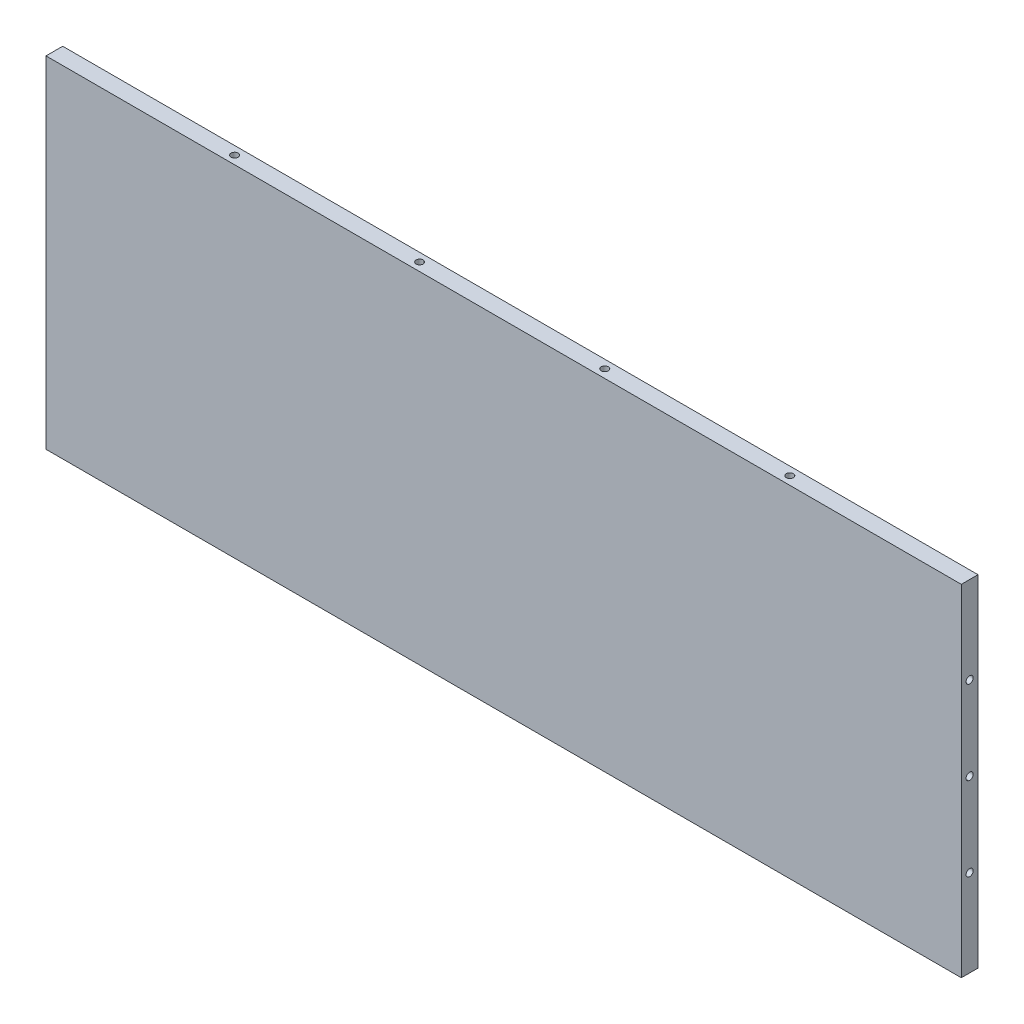
ISO-10303-21;
HEADER;
FILE_DESCRIPTION(('STEP AP214'),'2;1');
FILE_NAME('part.step','',(''),(''),'','','');
FILE_SCHEMA(('AUTOMOTIVE_DESIGN { 1 0 10303 214 1 1 1 1 }'));
ENDSEC;
DATA;
#1=APPLICATION_CONTEXT('core data for automotive mechanical design processes');
#2=APPLICATION_PROTOCOL_DEFINITION('international standard','automotive_design',2000,#1);
#3=PRODUCT_CONTEXT('',#1,'mechanical');
#4=PRODUCT('Part','Part','',(#3));
#5=PRODUCT_RELATED_PRODUCT_CATEGORY('part','',(#4));
#6=PRODUCT_DEFINITION_FORMATION('','',#4);
#7=PRODUCT_DEFINITION_CONTEXT('part definition',#1,'design');
#8=PRODUCT_DEFINITION('design','',#6,#7);
#9=PRODUCT_DEFINITION_SHAPE('','',#8);
#10=(LENGTH_UNIT() NAMED_UNIT(*) SI_UNIT(.MILLI.,.METRE.));
#11=(NAMED_UNIT(*) PLANE_ANGLE_UNIT() SI_UNIT($,.RADIAN.));
#12=(NAMED_UNIT(*) SI_UNIT($,.STERADIAN.) SOLID_ANGLE_UNIT());
#13=UNCERTAINTY_MEASURE_WITH_UNIT(LENGTH_MEASURE(1.E-05),#10,'distance_accuracy_value','');
#14=(GEOMETRIC_REPRESENTATION_CONTEXT(3) GLOBAL_UNCERTAINTY_ASSIGNED_CONTEXT((#13)) GLOBAL_UNIT_ASSIGNED_CONTEXT((#10,
#11,#12)) REPRESENTATION_CONTEXT('',''));
#15=CARTESIAN_POINT('',(0.,0.,0.));
#16=DIRECTION('',(0.,0.,1.));
#17=DIRECTION('',(1.,0.,0.));
#18=AXIS2_PLACEMENT_3D('',#15,#16,#17);
#19=CARTESIAN_POINT('',(0.,0.,6.34999999999999));
#20=DIRECTION('',(1.,0.,0.));
#21=DIRECTION('',(0.,0.,-0.999999999999998));
#22=AXIS2_PLACEMENT_3D('',#19,#20,#21);
#23=PLANE('',#22);
#24=CARTESIAN_POINT('',(0.,96.5199999999997,3.17499999999998));
#25=DIRECTION('',(-1.,0.,0.));
#26=DIRECTION('',(0.,0.,0.999999999999998));
#27=AXIS2_PLACEMENT_3D('',#24,#25,#26);
#28=CIRCLE('',#27,1.18744999999999);
#29=CARTESIAN_POINT('',(0.,96.5199999999997,4.36244999999997));
#30=VERTEX_POINT('',#29);
#31=EDGE_CURVE('E201',#30,#30,#28,.T.);
#32=ORIENTED_EDGE('',*,*,#31,.F.);
#33=EDGE_LOOP('',(#32));
#34=FACE_BOUND('',#33,.T.);
#35=CARTESIAN_POINT('',(0.,64.7699999999997,3.17499999999998));
#36=DIRECTION('',(-1.,0.,0.));
#37=DIRECTION('',(0.,0.,0.999999999999998));
#38=AXIS2_PLACEMENT_3D('',#35,#36,#37);
#39=CIRCLE('',#38,1.18744999999999);
#40=CARTESIAN_POINT('',(0.,64.7699999999997,4.36244999999997));
#41=VERTEX_POINT('',#40);
#42=EDGE_CURVE('E207',#41,#41,#39,.T.);
#43=ORIENTED_EDGE('',*,*,#42,.F.);
#44=EDGE_LOOP('',(#43));
#45=FACE_BOUND('',#44,.T.);
#46=CARTESIAN_POINT('',(0.,33.0199999999998,3.17499999999998));
#47=DIRECTION('',(-1.,0.,0.));
#48=DIRECTION('',(0.,0.,0.999999999999998));
#49=AXIS2_PLACEMENT_3D('',#46,#47,#48);
#50=CIRCLE('',#49,1.18744999999999);
#51=CARTESIAN_POINT('',(0.,33.0199999999998,4.36244999999997));
#52=VERTEX_POINT('',#51);
#53=EDGE_CURVE('E213',#52,#52,#50,.T.);
#54=ORIENTED_EDGE('',*,*,#53,.F.);
#55=EDGE_LOOP('',(#54));
#56=FACE_BOUND('',#55,.T.);
#57=DIRECTION('',(0.,-0.999999999999998,0.));
#58=VECTOR('',#57,1.);
#59=CARTESIAN_POINT('',(0.,0.,0.));
#60=LINE('',#59,#58);
#61=CARTESIAN_POINT('',(0.,129.54,0.));
#62=VERTEX_POINT('',#61);
#63=CARTESIAN_POINT('',(0.,0.,0.));
#64=VERTEX_POINT('',#63);
#65=EDGE_CURVE('E219',#62,#64,#60,.T.);
#66=ORIENTED_EDGE('',*,*,#65,.T.);
#67=DIRECTION('',(0.,0.,-0.999999999999998));
#68=VECTOR('',#67,1.);
#69=CARTESIAN_POINT('',(0.,0.,6.34999999999999));
#70=LINE('',#69,#68);
#71=CARTESIAN_POINT('',(0.,0.,6.34999999999999));
#72=VERTEX_POINT('',#71);
#73=EDGE_CURVE('E11',#72,#64,#70,.T.);
#74=ORIENTED_EDGE('',*,*,#73,.F.);
#75=DIRECTION('',(0.,-0.999999999999998,0.));
#76=VECTOR('',#75,1.);
#77=CARTESIAN_POINT('',(0.,0.,6.34999999999999));
#78=LINE('',#77,#76);
#79=CARTESIAN_POINT('',(0.,129.54,6.34999999999999));
#80=VERTEX_POINT('',#79);
#81=EDGE_CURVE('E220',#80,#72,#78,.T.);
#82=ORIENTED_EDGE('',*,*,#81,.F.);
#83=DIRECTION('',(0.,0.,-0.999999999999998));
#84=VECTOR('',#83,1.);
#85=CARTESIAN_POINT('',(0.,129.54,6.34999999999999));
#86=LINE('',#85,#84);
#87=EDGE_CURVE('E226',#80,#62,#86,.T.);
#88=ORIENTED_EDGE('',*,*,#87,.T.);
#89=EDGE_LOOP('',(#66,#74,#82,#88));
#90=FACE_BOUND('',#89,.T.);
#91=ADVANCED_FACE('F36',(#34,#45,#56,#90),#23,.F.);
#92=CARTESIAN_POINT('',(0.,0.,6.34999999999999));
#93=DIRECTION('',(0.,0.999999999999998,0.));
#94=DIRECTION('',(0.,0.,0.999999999999998));
#95=AXIS2_PLACEMENT_3D('',#92,#93,#94);
#96=PLANE('',#95);
#97=CARTESIAN_POINT('',(68.5292,0.,3.17499999999983));
#98=DIRECTION('',(0.,-0.999999999999998,0.));
#99=DIRECTION('',(0.,0.,-0.999999999999998));
#100=AXIS2_PLACEMENT_3D('',#97,#98,#99);
#101=CIRCLE('',#100,1.35254999999999);
#102=CARTESIAN_POINT('',(68.5292,0.,1.82244999999984));
#103=VERTEX_POINT('',#102);
#104=EDGE_CURVE('E153',#103,#103,#101,.T.);
#105=ORIENTED_EDGE('',*,*,#104,.F.);
#106=EDGE_LOOP('',(#105));
#107=FACE_BOUND('',#106,.T.);
#108=CARTESIAN_POINT('',(138.8872,0.,3.17500000000001));
#109=DIRECTION('',(0.,-0.999999999999998,0.));
#110=DIRECTION('',(0.,0.,-0.999999999999998));
#111=AXIS2_PLACEMENT_3D('',#108,#109,#110);
#112=CIRCLE('',#111,1.35254999999998);
#113=CARTESIAN_POINT('',(138.8872,0.,1.82245000000003));
#114=VERTEX_POINT('',#113);
#115=EDGE_CURVE('E159',#114,#114,#112,.T.);
#116=ORIENTED_EDGE('',*,*,#115,.F.);
#117=EDGE_LOOP('',(#116));
#118=FACE_BOUND('',#117,.T.);
#119=CARTESIAN_POINT('',(209.2452,0.,3.17500000000003));
#120=DIRECTION('',(0.,-0.999999999999998,0.));
#121=DIRECTION('',(0.,0.,-0.999999999999998));
#122=AXIS2_PLACEMENT_3D('',#119,#120,#121);
#123=CIRCLE('',#122,1.35254999999998);
#124=CARTESIAN_POINT('',(209.2452,0.,1.82245000000005));
#125=VERTEX_POINT('',#124);
#126=EDGE_CURVE('E165',#125,#125,#123,.T.);
#127=ORIENTED_EDGE('',*,*,#126,.F.);
#128=EDGE_LOOP('',(#127));
#129=FACE_BOUND('',#128,.T.);
#130=CARTESIAN_POINT('',(279.6032,0.,3.1749999999999));
#131=DIRECTION('',(0.,-0.999999999999998,0.));
#132=DIRECTION('',(0.,0.,-0.999999999999998));
#133=AXIS2_PLACEMENT_3D('',#130,#131,#132);
#134=CIRCLE('',#133,1.35255000000001);
#135=CARTESIAN_POINT('',(279.6032,0.,1.8224499999999));
#136=VERTEX_POINT('',#135);
#137=EDGE_CURVE('E171',#136,#136,#134,.T.);
#138=ORIENTED_EDGE('',*,*,#137,.F.);
#139=EDGE_LOOP('',(#138));
#140=FACE_BOUND('',#139,.T.);
#141=DIRECTION('',(1.,0.,0.));
#142=VECTOR('',#141,1.);
#143=CARTESIAN_POINT('',(0.,0.,0.));
#144=LINE('',#143,#142);
#145=CARTESIAN_POINT('',(347.98,0.,-1.52655665885959E-13));
#146=VERTEX_POINT('',#145);
#147=EDGE_CURVE('E229',#64,#146,#144,.T.);
#148=ORIENTED_EDGE('',*,*,#147,.T.);
#149=DIRECTION('',(0.,0.,-0.999999999999998));
#150=VECTOR('',#149,1.);
#151=CARTESIAN_POINT('',(347.98,0.,6.34999999999986));
#152=LINE('',#151,#150);
#153=CARTESIAN_POINT('',(347.98,0.,6.34999999999986));
#154=VERTEX_POINT('',#153);
#155=EDGE_CURVE('E44',#154,#146,#152,.T.);
#156=ORIENTED_EDGE('',*,*,#155,.F.);
#157=DIRECTION('',(1.,0.,0.));
#158=VECTOR('',#157,1.);
#159=CARTESIAN_POINT('',(0.,0.,6.34999999999999));
#160=LINE('',#159,#158);
#161=EDGE_CURVE('E83',#72,#154,#160,.T.);
#162=ORIENTED_EDGE('',*,*,#161,.F.);
#163=ORIENTED_EDGE('',*,*,#73,.T.);
#164=EDGE_LOOP('',(#148,#156,#162,#163));
#165=FACE_BOUND('',#164,.T.);
#166=ADVANCED_FACE('F253',(#107,#118,#129,#140,#165),#96,.F.);
#167=CARTESIAN_POINT('',(347.98,0.,6.34999999999986));
#168=DIRECTION('',(-1.,0.,0.));
#169=DIRECTION('',(0.,0.,0.999999999999998));
#170=AXIS2_PLACEMENT_3D('',#167,#168,#169);
#171=PLANE('',#170);
#172=CARTESIAN_POINT('',(347.98,64.7699999999997,3.17499999999984));
#173=DIRECTION('',(1.,0.,0.));
#174=DIRECTION('',(0.,0.,-0.999999999999998));
#175=AXIS2_PLACEMENT_3D('',#172,#173,#174);
#176=CIRCLE('',#175,1.35254999999999);
#177=CARTESIAN_POINT('',(347.98,64.7699999999997,1.82244999999985));
#178=VERTEX_POINT('',#177);
#179=EDGE_CURVE('E137',#178,#178,#176,.T.);
#180=ORIENTED_EDGE('',*,*,#179,.F.);
#181=EDGE_LOOP('',(#180));
#182=FACE_BOUND('',#181,.T.);
#183=CARTESIAN_POINT('',(347.98,96.5199999999995,3.17499999999984));
#184=DIRECTION('',(1.,0.,0.));
#185=DIRECTION('',(0.,0.,-0.999999999999998));
#186=AXIS2_PLACEMENT_3D('',#183,#184,#185);
#187=CIRCLE('',#186,1.35254999999999);
#188=CARTESIAN_POINT('',(347.98,96.5199999999995,1.82244999999985));
#189=VERTEX_POINT('',#188);
#190=EDGE_CURVE('E136',#189,#189,#187,.T.);
#191=ORIENTED_EDGE('',*,*,#190,.F.);
#192=EDGE_LOOP('',(#191));
#193=FACE_BOUND('',#192,.T.);
#194=CARTESIAN_POINT('',(347.98,33.0199999999998,3.17499999999984));
#195=DIRECTION('',(1.,0.,0.));
#196=DIRECTION('',(0.,0.,-0.999999999999998));
#197=AXIS2_PLACEMENT_3D('',#194,#195,#196);
#198=CIRCLE('',#197,1.35255);
#199=CARTESIAN_POINT('',(347.98,33.0199999999998,1.82244999999985));
#200=VERTEX_POINT('',#199);
#201=EDGE_CURVE('E147',#200,#200,#198,.T.);
#202=ORIENTED_EDGE('',*,*,#201,.F.);
#203=EDGE_LOOP('',(#202));
#204=FACE_BOUND('',#203,.T.);
#205=DIRECTION('',(0.,0.999999999999998,0.));
#206=VECTOR('',#205,1.);
#207=CARTESIAN_POINT('',(347.98,0.,-1.52655665885959E-13));
#208=LINE('',#207,#206);
#209=CARTESIAN_POINT('',(347.98,129.539999999999,-1.52655665885959E-13));
#210=VERTEX_POINT('',#209);
#211=EDGE_CURVE('E70',#146,#210,#208,.T.);
#212=ORIENTED_EDGE('',*,*,#211,.T.);
#213=DIRECTION('',(0.,0.,-0.999999999999998));
#214=VECTOR('',#213,1.);
#215=CARTESIAN_POINT('',(347.98,129.539999999999,6.34999999999986));
#216=LINE('',#215,#214);
#217=CARTESIAN_POINT('',(347.98,129.539999999999,6.34999999999986));
#218=VERTEX_POINT('',#217);
#219=EDGE_CURVE('E234',#218,#210,#216,.T.);
#220=ORIENTED_EDGE('',*,*,#219,.F.);
#221=DIRECTION('',(0.,0.999999999999998,0.));
#222=VECTOR('',#221,1.);
#223=CARTESIAN_POINT('',(347.98,0.,6.34999999999986));
#224=LINE('',#223,#222);
#225=EDGE_CURVE('E223',#154,#218,#224,.T.);
#226=ORIENTED_EDGE('',*,*,#225,.F.);
#227=ORIENTED_EDGE('',*,*,#155,.T.);
#228=EDGE_LOOP('',(#212,#220,#226,#227));
#229=FACE_BOUND('',#228,.T.);
#230=ADVANCED_FACE('F236',(#182,#193,#204,#229),#171,.F.);
#231=CARTESIAN_POINT('',(0.,129.54,6.34999999999999));
#232=DIRECTION('',(0.,-0.999999999999998,0.));
#233=DIRECTION('',(0.,0.,-0.999999999999998));
#234=AXIS2_PLACEMENT_3D('',#231,#232,#233);
#235=PLANE('',#234);
#236=CARTESIAN_POINT('',(279.6032,129.54,3.17499999999982));
#237=DIRECTION('',(0.,0.999999999999998,0.));
#238=DIRECTION('',(0.,0.,0.999999999999998));
#239=AXIS2_PLACEMENT_3D('',#236,#237,#238);
#240=CIRCLE('',#239,1.35255000000001);
#241=CARTESIAN_POINT('',(279.6032,129.54,4.52754999999982));
#242=VERTEX_POINT('',#241);
#243=EDGE_CURVE('E177',#242,#242,#240,.T.);
#244=ORIENTED_EDGE('',*,*,#243,.F.);
#245=EDGE_LOOP('',(#244));
#246=FACE_BOUND('',#245,.T.);
#247=CARTESIAN_POINT('',(209.2452,129.54,3.17499999999997));
#248=DIRECTION('',(0.,0.999999999999998,0.));
#249=DIRECTION('',(0.,0.,0.999999999999998));
#250=AXIS2_PLACEMENT_3D('',#247,#248,#249);
#251=CIRCLE('',#250,1.35254999999998);
#252=CARTESIAN_POINT('',(209.2452,129.54,4.52754999999995));
#253=VERTEX_POINT('',#252);
#254=EDGE_CURVE('E183',#253,#253,#251,.T.);
#255=ORIENTED_EDGE('',*,*,#254,.F.);
#256=EDGE_LOOP('',(#255));
#257=FACE_BOUND('',#256,.T.);
#258=CARTESIAN_POINT('',(138.8872,129.539999999999,3.17499999999998));
#259=DIRECTION('',(0.,0.999999999999998,0.));
#260=DIRECTION('',(0.,0.,0.999999999999998));
#261=AXIS2_PLACEMENT_3D('',#258,#259,#260);
#262=CIRCLE('',#261,1.35254999999998);
#263=CARTESIAN_POINT('',(138.8872,129.539999999999,4.52754999999996));
#264=VERTEX_POINT('',#263);
#265=EDGE_CURVE('E189',#264,#264,#262,.T.);
#266=ORIENTED_EDGE('',*,*,#265,.F.);
#267=EDGE_LOOP('',(#266));
#268=FACE_BOUND('',#267,.T.);
#269=CARTESIAN_POINT('',(68.5291999999998,129.539999999999,3.17499999999986));
#270=DIRECTION('',(0.,0.999999999999998,0.));
#271=DIRECTION('',(0.,0.,0.999999999999998));
#272=AXIS2_PLACEMENT_3D('',#269,#270,#271);
#273=CIRCLE('',#272,1.35254999999999);
#274=CARTESIAN_POINT('',(68.5291999999998,129.539999999999,4.52754999999985));
#275=VERTEX_POINT('',#274);
#276=EDGE_CURVE('E195',#275,#275,#273,.T.);
#277=ORIENTED_EDGE('',*,*,#276,.F.);
#278=EDGE_LOOP('',(#277));
#279=FACE_BOUND('',#278,.T.);
#280=DIRECTION('',(-1.,0.,0.));
#281=VECTOR('',#280,1.);
#282=CARTESIAN_POINT('',(0.,129.54,0.));
#283=LINE('',#282,#281);
#284=EDGE_CURVE('E76',#210,#62,#283,.T.);
#285=ORIENTED_EDGE('',*,*,#284,.T.);
#286=ORIENTED_EDGE('',*,*,#87,.F.);
#287=DIRECTION('',(-1.,0.,0.));
#288=VECTOR('',#287,1.);
#289=CARTESIAN_POINT('',(0.,129.54,6.34999999999999));
#290=LINE('',#289,#288);
#291=EDGE_CURVE('E52',#218,#80,#290,.T.);
#292=ORIENTED_EDGE('',*,*,#291,.F.);
#293=ORIENTED_EDGE('',*,*,#219,.T.);
#294=EDGE_LOOP('',(#285,#286,#292,#293));
#295=FACE_BOUND('',#294,.T.);
#296=ADVANCED_FACE('F243',(#246,#257,#268,#279,#295),#235,.F.);
#297=CARTESIAN_POINT('',(0.,0.,6.34999999999999));
#298=DIRECTION('',(0.,0.,-0.999999999999998));
#299=DIRECTION('',(-1.,0.,0.));
#300=AXIS2_PLACEMENT_3D('',#297,#298,#299);
#301=PLANE('',#300);
#302=ORIENTED_EDGE('',*,*,#81,.T.);
#303=ORIENTED_EDGE('',*,*,#161,.T.);
#304=ORIENTED_EDGE('',*,*,#225,.T.);
#305=ORIENTED_EDGE('',*,*,#291,.T.);
#306=EDGE_LOOP('',(#302,#303,#304,#305));
#307=FACE_BOUND('',#306,.T.);
#308=ADVANCED_FACE('F245',(#307),#301,.F.);
#309=CARTESIAN_POINT('',(0.,0.,0.));
#310=DIRECTION('',(0.,0.,-0.999999999999998));
#311=DIRECTION('',(-1.,0.,0.));
#312=AXIS2_PLACEMENT_3D('',#309,#310,#311);
#313=PLANE('',#312);
#314=ORIENTED_EDGE('',*,*,#65,.F.);
#315=ORIENTED_EDGE('',*,*,#284,.F.);
#316=ORIENTED_EDGE('',*,*,#211,.F.);
#317=ORIENTED_EDGE('',*,*,#147,.F.);
#318=EDGE_LOOP('',(#314,#315,#316,#317));
#319=FACE_BOUND('',#318,.T.);
#320=ADVANCED_FACE('F239',(#319),#313,.T.);
#321=CARTESIAN_POINT('',(17.78,33.0199999999998,3.17499999999998));
#322=DIRECTION('',(-1.,0.,0.));
#323=DIRECTION('',(0.,0.,0.999999999999998));
#324=AXIS2_PLACEMENT_3D('',#321,#322,#323);
#325=CONICAL_SURFACE('',#324,1.18744999999999,1.02974425867665);
#326=CARTESIAN_POINT('',(18.4934919420643,33.0199999999998,3.17499999999997));
#327=VERTEX_POINT('',#326);
#328=VERTEX_LOOP('',#327);
#329=FACE_BOUND('',#328,.T.);
#330=CARTESIAN_POINT('',(17.78,33.0199999999998,3.17499999999998));
#331=DIRECTION('',(-1.,0.,0.));
#332=DIRECTION('',(0.,0.,0.999999999999998));
#333=AXIS2_PLACEMENT_3D('',#330,#331,#332);
#334=CIRCLE('',#333,1.18744999999999);
#335=CARTESIAN_POINT('',(17.78,33.0199999999998,4.36244999999997));
#336=VERTEX_POINT('',#335);
#337=EDGE_CURVE('E216',#336,#336,#334,.T.);
#338=ORIENTED_EDGE('',*,*,#337,.T.);
#339=EDGE_LOOP('',(#338));
#340=FACE_BOUND('',#339,.T.);
#341=ADVANCED_FACE('F274',(#329,#340),#325,.F.);
#342=CARTESIAN_POINT('',(0.,33.0199999999998,3.17499999999998));
#343=DIRECTION('',(-1.,0.,0.));
#344=DIRECTION('',(0.,0.,0.999999999999998));
#345=AXIS2_PLACEMENT_3D('',#342,#343,#344);
#346=CYLINDRICAL_SURFACE('',#345,1.18744999999999);
#347=ORIENTED_EDGE('',*,*,#337,.F.);
#348=EDGE_LOOP('',(#347));
#349=FACE_BOUND('',#348,.T.);
#350=ORIENTED_EDGE('',*,*,#53,.T.);
#351=EDGE_LOOP('',(#350));
#352=FACE_BOUND('',#351,.T.);
#353=ADVANCED_FACE('F271',(#349,#352),#346,.F.);
#354=CARTESIAN_POINT('',(17.78,64.7699999999997,3.17499999999998));
#355=DIRECTION('',(-1.,0.,0.));
#356=DIRECTION('',(0.,0.,0.999999999999998));
#357=AXIS2_PLACEMENT_3D('',#354,#355,#356);
#358=CONICAL_SURFACE('',#357,1.18744999999999,1.02974425867665);
#359=CARTESIAN_POINT('',(18.4934919420643,64.7699999999997,3.17499999999997));
#360=VERTEX_POINT('',#359);
#361=VERTEX_LOOP('',#360);
#362=FACE_BOUND('',#361,.T.);
#363=CARTESIAN_POINT('',(17.78,64.7699999999997,3.17499999999998));
#364=DIRECTION('',(-1.,0.,0.));
#365=DIRECTION('',(0.,0.,0.999999999999998));
#366=AXIS2_PLACEMENT_3D('',#363,#364,#365);
#367=CIRCLE('',#366,1.18744999999999);
#368=CARTESIAN_POINT('',(17.78,64.7699999999997,4.36244999999997));
#369=VERTEX_POINT('',#368);
#370=EDGE_CURVE('E210',#369,#369,#367,.T.);
#371=ORIENTED_EDGE('',*,*,#370,.T.);
#372=EDGE_LOOP('',(#371));
#373=FACE_BOUND('',#372,.T.);
#374=ADVANCED_FACE('F273',(#362,#373),#358,.F.);
#375=CARTESIAN_POINT('',(0.,64.7699999999997,3.17499999999998));
#376=DIRECTION('',(-1.,0.,0.));
#377=DIRECTION('',(0.,0.,0.999999999999998));
#378=AXIS2_PLACEMENT_3D('',#375,#376,#377);
#379=CYLINDRICAL_SURFACE('',#378,1.18744999999999);
#380=ORIENTED_EDGE('',*,*,#370,.F.);
#381=EDGE_LOOP('',(#380));
#382=FACE_BOUND('',#381,.T.);
#383=ORIENTED_EDGE('',*,*,#42,.T.);
#384=EDGE_LOOP('',(#383));
#385=FACE_BOUND('',#384,.T.);
#386=ADVANCED_FACE('F281',(#382,#385),#379,.F.);
#387=CARTESIAN_POINT('',(17.7799999999999,96.5199999999995,3.17499999999998));
#388=DIRECTION('',(-1.,0.,0.));
#389=DIRECTION('',(0.,0.,0.999999999999998));
#390=AXIS2_PLACEMENT_3D('',#387,#388,#389);
#391=CONICAL_SURFACE('',#390,1.18744999999999,1.02974425867665);
#392=CARTESIAN_POINT('',(18.4934919420641,96.5199999999995,3.17499999999997));
#393=VERTEX_POINT('',#392);
#394=VERTEX_LOOP('',#393);
#395=FACE_BOUND('',#394,.T.);
#396=CARTESIAN_POINT('',(17.7799999999999,96.5199999999995,3.17499999999998));
#397=DIRECTION('',(-1.,0.,0.));
#398=DIRECTION('',(0.,0.,0.999999999999998));
#399=AXIS2_PLACEMENT_3D('',#396,#397,#398);
#400=CIRCLE('',#399,1.18744999999999);
#401=CARTESIAN_POINT('',(17.7799999999999,96.5199999999995,4.36244999999997));
#402=VERTEX_POINT('',#401);
#403=EDGE_CURVE('E204',#402,#402,#400,.T.);
#404=ORIENTED_EDGE('',*,*,#403,.T.);
#405=EDGE_LOOP('',(#404));
#406=FACE_BOUND('',#405,.T.);
#407=ADVANCED_FACE('F310',(#395,#406),#391,.F.);
#408=CARTESIAN_POINT('',(0.,96.5199999999997,3.17499999999998));
#409=DIRECTION('',(-1.,0.,0.));
#410=DIRECTION('',(0.,0.,0.999999999999998));
#411=AXIS2_PLACEMENT_3D('',#408,#409,#410);
#412=CYLINDRICAL_SURFACE('',#411,1.18744999999999);
#413=ORIENTED_EDGE('',*,*,#403,.F.);
#414=EDGE_LOOP('',(#413));
#415=FACE_BOUND('',#414,.T.);
#416=ORIENTED_EDGE('',*,*,#31,.T.);
#417=EDGE_LOOP('',(#416));
#418=FACE_BOUND('',#417,.T.);
#419=ADVANCED_FACE('F317',(#415,#418),#412,.F.);
#420=CARTESIAN_POINT('',(68.5291999999998,111.76,3.17499999999986));
#421=DIRECTION('',(0.,0.999999999999998,0.));
#422=DIRECTION('',(0.,0.,0.999999999999998));
#423=AXIS2_PLACEMENT_3D('',#420,#421,#422);
#424=CONICAL_SURFACE('',#423,1.35254999999998,1.02974425867665);
#425=CARTESIAN_POINT('',(68.5291999999998,110.947305969734,3.17499999999986));
#426=VERTEX_POINT('',#425);
#427=VERTEX_LOOP('',#426);
#428=FACE_BOUND('',#427,.T.);
#429=CARTESIAN_POINT('',(68.5291999999998,111.76,3.17499999999986));
#430=DIRECTION('',(0.,0.999999999999998,0.));
#431=DIRECTION('',(0.,0.,0.999999999999998));
#432=AXIS2_PLACEMENT_3D('',#429,#430,#431);
#433=CIRCLE('',#432,1.35254999999998);
#434=CARTESIAN_POINT('',(68.5291999999998,111.76,4.52754999999984));
#435=VERTEX_POINT('',#434);
#436=EDGE_CURVE('E198',#435,#435,#433,.T.);
#437=ORIENTED_EDGE('',*,*,#436,.T.);
#438=EDGE_LOOP('',(#437));
#439=FACE_BOUND('',#438,.T.);
#440=ADVANCED_FACE('F325',(#428,#439),#424,.F.);
#441=CARTESIAN_POINT('',(68.5291999999998,129.539999999999,3.17499999999986));
#442=DIRECTION('',(0.,0.999999999999998,0.));
#443=DIRECTION('',(0.,0.,0.999999999999998));
#444=AXIS2_PLACEMENT_3D('',#441,#442,#443);
#445=CYLINDRICAL_SURFACE('',#444,1.35254999999999);
#446=ORIENTED_EDGE('',*,*,#436,.F.);
#447=EDGE_LOOP('',(#446));
#448=FACE_BOUND('',#447,.T.);
#449=ORIENTED_EDGE('',*,*,#276,.T.);
#450=EDGE_LOOP('',(#449));
#451=FACE_BOUND('',#450,.T.);
#452=ADVANCED_FACE('F333',(#448,#451),#445,.F.);
#453=CARTESIAN_POINT('',(138.8872,111.76,3.17499999999998));
#454=DIRECTION('',(0.,0.999999999999998,0.));
#455=DIRECTION('',(0.,0.,0.999999999999998));
#456=AXIS2_PLACEMENT_3D('',#453,#454,#455);
#457=CONICAL_SURFACE('',#456,1.35254999999998,1.02974425867665);
#458=CARTESIAN_POINT('',(138.8872,110.947305969734,3.17499999999998));
#459=VERTEX_POINT('',#458);
#460=VERTEX_LOOP('',#459);
#461=FACE_BOUND('',#460,.T.);
#462=CARTESIAN_POINT('',(138.8872,111.76,3.17499999999998));
#463=DIRECTION('',(0.,0.999999999999998,0.));
#464=DIRECTION('',(0.,0.,0.999999999999998));
#465=AXIS2_PLACEMENT_3D('',#462,#463,#464);
#466=CIRCLE('',#465,1.35254999999998);
#467=CARTESIAN_POINT('',(138.8872,111.76,4.52754999999996));
#468=VERTEX_POINT('',#467);
#469=EDGE_CURVE('E192',#468,#468,#466,.T.);
#470=ORIENTED_EDGE('',*,*,#469,.T.);
#471=EDGE_LOOP('',(#470));
#472=FACE_BOUND('',#471,.T.);
#473=ADVANCED_FACE('F341',(#461,#472),#457,.F.);
#474=CARTESIAN_POINT('',(138.8872,129.539999999999,3.17499999999998));
#475=DIRECTION('',(0.,0.999999999999998,0.));
#476=DIRECTION('',(0.,0.,0.999999999999998));
#477=AXIS2_PLACEMENT_3D('',#474,#475,#476);
#478=CYLINDRICAL_SURFACE('',#477,1.35254999999998);
#479=ORIENTED_EDGE('',*,*,#469,.F.);
#480=EDGE_LOOP('',(#479));
#481=FACE_BOUND('',#480,.T.);
#482=ORIENTED_EDGE('',*,*,#265,.T.);
#483=EDGE_LOOP('',(#482));
#484=FACE_BOUND('',#483,.T.);
#485=ADVANCED_FACE('F349',(#481,#484),#478,.F.);
#486=CARTESIAN_POINT('',(209.2452,111.76,3.17499999999997));
#487=DIRECTION('',(0.,0.999999999999998,0.));
#488=DIRECTION('',(0.,0.,0.999999999999998));
#489=AXIS2_PLACEMENT_3D('',#486,#487,#488);
#490=CONICAL_SURFACE('',#489,1.35254999999998,1.02974425867665);
#491=CARTESIAN_POINT('',(209.2452,110.947305969734,3.17499999999997));
#492=VERTEX_POINT('',#491);
#493=VERTEX_LOOP('',#492);
#494=FACE_BOUND('',#493,.T.);
#495=CARTESIAN_POINT('',(209.2452,111.76,3.17499999999997));
#496=DIRECTION('',(0.,0.999999999999998,0.));
#497=DIRECTION('',(0.,0.,0.999999999999998));
#498=AXIS2_PLACEMENT_3D('',#495,#496,#497);
#499=CIRCLE('',#498,1.35254999999998);
#500=CARTESIAN_POINT('',(209.2452,111.76,4.52754999999995));
#501=VERTEX_POINT('',#500);
#502=EDGE_CURVE('E186',#501,#501,#499,.T.);
#503=ORIENTED_EDGE('',*,*,#502,.T.);
#504=EDGE_LOOP('',(#503));
#505=FACE_BOUND('',#504,.T.);
#506=ADVANCED_FACE('F357',(#494,#505),#490,.F.);
#507=CARTESIAN_POINT('',(209.2452,129.54,3.17499999999997));
#508=DIRECTION('',(0.,0.999999999999998,0.));
#509=DIRECTION('',(0.,0.,0.999999999999998));
#510=AXIS2_PLACEMENT_3D('',#507,#508,#509);
#511=CYLINDRICAL_SURFACE('',#510,1.35254999999998);
#512=ORIENTED_EDGE('',*,*,#502,.F.);
#513=EDGE_LOOP('',(#512));
#514=FACE_BOUND('',#513,.T.);
#515=ORIENTED_EDGE('',*,*,#254,.T.);
#516=EDGE_LOOP('',(#515));
#517=FACE_BOUND('',#516,.T.);
#518=ADVANCED_FACE('F365',(#514,#517),#511,.F.);
#519=CARTESIAN_POINT('',(279.6032,111.76,3.17499999999982));
#520=DIRECTION('',(0.,0.999999999999998,0.));
#521=DIRECTION('',(0.,0.,0.999999999999998));
#522=AXIS2_PLACEMENT_3D('',#519,#520,#521);
#523=CONICAL_SURFACE('',#522,1.35255000000001,1.02974425867666);
#524=CARTESIAN_POINT('',(279.6032,110.947305969734,3.17499999999982));
#525=VERTEX_POINT('',#524);
#526=VERTEX_LOOP('',#525);
#527=FACE_BOUND('',#526,.T.);
#528=CARTESIAN_POINT('',(279.6032,111.76,3.17499999999982));
#529=DIRECTION('',(0.,0.999999999999998,0.));
#530=DIRECTION('',(0.,0.,0.999999999999998));
#531=AXIS2_PLACEMENT_3D('',#528,#529,#530);
#532=CIRCLE('',#531,1.35255000000001);
#533=CARTESIAN_POINT('',(279.6032,111.76,4.52754999999982));
#534=VERTEX_POINT('',#533);
#535=EDGE_CURVE('E180',#534,#534,#532,.T.);
#536=ORIENTED_EDGE('',*,*,#535,.T.);
#537=EDGE_LOOP('',(#536));
#538=FACE_BOUND('',#537,.T.);
#539=ADVANCED_FACE('F373',(#527,#538),#523,.F.);
#540=CARTESIAN_POINT('',(279.6032,129.54,3.17499999999982));
#541=DIRECTION('',(0.,0.999999999999998,0.));
#542=DIRECTION('',(0.,0.,0.999999999999998));
#543=AXIS2_PLACEMENT_3D('',#540,#541,#542);
#544=CYLINDRICAL_SURFACE('',#543,1.35255000000001);
#545=ORIENTED_EDGE('',*,*,#535,.F.);
#546=EDGE_LOOP('',(#545));
#547=FACE_BOUND('',#546,.T.);
#548=ORIENTED_EDGE('',*,*,#243,.T.);
#549=EDGE_LOOP('',(#548));
#550=FACE_BOUND('',#549,.T.);
#551=ADVANCED_FACE('F381',(#547,#550),#544,.F.);
#552=CARTESIAN_POINT('',(279.6032,17.78,3.1749999999999));
#553=DIRECTION('',(0.,-0.999999999999998,0.));
#554=DIRECTION('',(0.,0.,-0.999999999999998));
#555=AXIS2_PLACEMENT_3D('',#552,#553,#554);
#556=CONICAL_SURFACE('',#555,1.35255000000001,1.02974425867666);
#557=CARTESIAN_POINT('',(279.6032,18.5926940302657,3.1749999999999));
#558=VERTEX_POINT('',#557);
#559=VERTEX_LOOP('',#558);
#560=FACE_BOUND('',#559,.T.);
#561=CARTESIAN_POINT('',(279.6032,17.78,3.1749999999999));
#562=DIRECTION('',(0.,-0.999999999999998,0.));
#563=DIRECTION('',(0.,0.,-0.999999999999998));
#564=AXIS2_PLACEMENT_3D('',#561,#562,#563);
#565=CIRCLE('',#564,1.35255000000001);
#566=CARTESIAN_POINT('',(279.6032,17.78,1.8224499999999));
#567=VERTEX_POINT('',#566);
#568=EDGE_CURVE('E174',#567,#567,#565,.T.);
#569=ORIENTED_EDGE('',*,*,#568,.T.);
#570=EDGE_LOOP('',(#569));
#571=FACE_BOUND('',#570,.T.);
#572=ADVANCED_FACE('F389',(#560,#571),#556,.F.);
#573=CARTESIAN_POINT('',(279.6032,0.,3.1749999999999));
#574=DIRECTION('',(0.,-0.999999999999998,0.));
#575=DIRECTION('',(0.,0.,-0.999999999999998));
#576=AXIS2_PLACEMENT_3D('',#573,#574,#575);
#577=CYLINDRICAL_SURFACE('',#576,1.35255000000001);
#578=ORIENTED_EDGE('',*,*,#568,.F.);
#579=EDGE_LOOP('',(#578));
#580=FACE_BOUND('',#579,.T.);
#581=ORIENTED_EDGE('',*,*,#137,.T.);
#582=EDGE_LOOP('',(#581));
#583=FACE_BOUND('',#582,.T.);
#584=ADVANCED_FACE('F397',(#580,#583),#577,.F.);
#585=CARTESIAN_POINT('',(209.2452,17.78,3.17500000000003));
#586=DIRECTION('',(0.,-0.999999999999998,0.));
#587=DIRECTION('',(0.,0.,-0.999999999999998));
#588=AXIS2_PLACEMENT_3D('',#585,#586,#587);
#589=CONICAL_SURFACE('',#588,1.35254999999998,1.02974425867665);
#590=CARTESIAN_POINT('',(209.2452,18.5926940302657,3.17500000000003));
#591=VERTEX_POINT('',#590);
#592=VERTEX_LOOP('',#591);
#593=FACE_BOUND('',#592,.T.);
#594=CARTESIAN_POINT('',(209.2452,17.78,3.17500000000003));
#595=DIRECTION('',(0.,-0.999999999999998,0.));
#596=DIRECTION('',(0.,0.,-0.999999999999998));
#597=AXIS2_PLACEMENT_3D('',#594,#595,#596);
#598=CIRCLE('',#597,1.35254999999998);
#599=CARTESIAN_POINT('',(209.2452,17.78,1.82245000000005));
#600=VERTEX_POINT('',#599);
#601=EDGE_CURVE('E168',#600,#600,#598,.T.);
#602=ORIENTED_EDGE('',*,*,#601,.T.);
#603=EDGE_LOOP('',(#602));
#604=FACE_BOUND('',#603,.T.);
#605=ADVANCED_FACE('F405',(#593,#604),#589,.F.);
#606=CARTESIAN_POINT('',(209.2452,0.,3.17500000000003));
#607=DIRECTION('',(0.,-0.999999999999998,0.));
#608=DIRECTION('',(0.,0.,-0.999999999999998));
#609=AXIS2_PLACEMENT_3D('',#606,#607,#608);
#610=CYLINDRICAL_SURFACE('',#609,1.35254999999998);
#611=ORIENTED_EDGE('',*,*,#601,.F.);
#612=EDGE_LOOP('',(#611));
#613=FACE_BOUND('',#612,.T.);
#614=ORIENTED_EDGE('',*,*,#126,.T.);
#615=EDGE_LOOP('',(#614));
#616=FACE_BOUND('',#615,.T.);
#617=ADVANCED_FACE('F413',(#613,#616),#610,.F.);
#618=CARTESIAN_POINT('',(138.8872,17.78,3.17500000000001));
#619=DIRECTION('',(0.,-0.999999999999998,0.));
#620=DIRECTION('',(0.,0.,-0.999999999999998));
#621=AXIS2_PLACEMENT_3D('',#618,#619,#620);
#622=CONICAL_SURFACE('',#621,1.35254999999998,1.02974425867665);
#623=CARTESIAN_POINT('',(138.8872,18.5926940302657,3.17500000000001));
#624=VERTEX_POINT('',#623);
#625=VERTEX_LOOP('',#624);
#626=FACE_BOUND('',#625,.T.);
#627=CARTESIAN_POINT('',(138.8872,17.78,3.17500000000001));
#628=DIRECTION('',(0.,-0.999999999999998,0.));
#629=DIRECTION('',(0.,0.,-0.999999999999998));
#630=AXIS2_PLACEMENT_3D('',#627,#628,#629);
#631=CIRCLE('',#630,1.35254999999998);
#632=CARTESIAN_POINT('',(138.8872,17.78,1.82245000000003));
#633=VERTEX_POINT('',#632);
#634=EDGE_CURVE('E162',#633,#633,#631,.T.);
#635=ORIENTED_EDGE('',*,*,#634,.T.);
#636=EDGE_LOOP('',(#635));
#637=FACE_BOUND('',#636,.T.);
#638=ADVANCED_FACE('F421',(#626,#637),#622,.F.);
#639=CARTESIAN_POINT('',(138.8872,0.,3.17500000000001));
#640=DIRECTION('',(0.,-0.999999999999998,0.));
#641=DIRECTION('',(0.,0.,-0.999999999999998));
#642=AXIS2_PLACEMENT_3D('',#639,#640,#641);
#643=CYLINDRICAL_SURFACE('',#642,1.35254999999998);
#644=ORIENTED_EDGE('',*,*,#634,.F.);
#645=EDGE_LOOP('',(#644));
#646=FACE_BOUND('',#645,.T.);
#647=ORIENTED_EDGE('',*,*,#115,.T.);
#648=EDGE_LOOP('',(#647));
#649=FACE_BOUND('',#648,.T.);
#650=ADVANCED_FACE('F429',(#646,#649),#643,.F.);
#651=CARTESIAN_POINT('',(68.5292,17.78,3.17499999999983));
#652=DIRECTION('',(0.,-0.999999999999998,0.));
#653=DIRECTION('',(0.,0.,-0.999999999999998));
#654=AXIS2_PLACEMENT_3D('',#651,#652,#653);
#655=CONICAL_SURFACE('',#654,1.35254999999998,1.02974425867665);
#656=CARTESIAN_POINT('',(68.5292,18.5926940302657,3.17499999999983));
#657=VERTEX_POINT('',#656);
#658=VERTEX_LOOP('',#657);
#659=FACE_BOUND('',#658,.T.);
#660=CARTESIAN_POINT('',(68.5292,17.78,3.17499999999983));
#661=DIRECTION('',(0.,-0.999999999999998,0.));
#662=DIRECTION('',(0.,0.,-0.999999999999998));
#663=AXIS2_PLACEMENT_3D('',#660,#661,#662);
#664=CIRCLE('',#663,1.35254999999998);
#665=CARTESIAN_POINT('',(68.5292,17.78,1.82244999999985));
#666=VERTEX_POINT('',#665);
#667=EDGE_CURVE('E156',#666,#666,#664,.T.);
#668=ORIENTED_EDGE('',*,*,#667,.T.);
#669=EDGE_LOOP('',(#668));
#670=FACE_BOUND('',#669,.T.);
#671=ADVANCED_FACE('F437',(#659,#670),#655,.F.);
#672=CARTESIAN_POINT('',(68.5292,0.,3.17499999999983));
#673=DIRECTION('',(0.,-0.999999999999998,0.));
#674=DIRECTION('',(0.,0.,-0.999999999999998));
#675=AXIS2_PLACEMENT_3D('',#672,#673,#674);
#676=CYLINDRICAL_SURFACE('',#675,1.35254999999999);
#677=ORIENTED_EDGE('',*,*,#667,.F.);
#678=EDGE_LOOP('',(#677));
#679=FACE_BOUND('',#678,.T.);
#680=ORIENTED_EDGE('',*,*,#104,.T.);
#681=EDGE_LOOP('',(#680));
#682=FACE_BOUND('',#681,.T.);
#683=ADVANCED_FACE('F445',(#679,#682),#676,.F.);
#684=CARTESIAN_POINT('',(330.2,33.0199999999998,3.17499999999998));
#685=DIRECTION('',(1.,0.,0.));
#686=DIRECTION('',(0.,0.,-0.999999999999998));
#687=AXIS2_PLACEMENT_3D('',#684,#685,#686);
#688=CONICAL_SURFACE('',#687,1.35254999999999,1.02974425867667);
#689=CARTESIAN_POINT('',(329.387305969734,33.0199999999998,3.17499999999998));
#690=VERTEX_POINT('',#689);
#691=VERTEX_LOOP('',#690);
#692=FACE_BOUND('',#691,.T.);
#693=CARTESIAN_POINT('',(330.2,33.0199999999998,3.17499999999998));
#694=DIRECTION('',(1.,0.,0.));
#695=DIRECTION('',(0.,0.,-0.999999999999998));
#696=AXIS2_PLACEMENT_3D('',#693,#694,#695);
#697=CIRCLE('',#696,1.35254999999999);
#698=CARTESIAN_POINT('',(330.2,33.0199999999998,1.82244999999999));
#699=VERTEX_POINT('',#698);
#700=EDGE_CURVE('E150',#699,#699,#697,.T.);
#701=ORIENTED_EDGE('',*,*,#700,.T.);
#702=EDGE_LOOP('',(#701));
#703=FACE_BOUND('',#702,.T.);
#704=ADVANCED_FACE('F453',(#692,#703),#688,.F.);
#705=CARTESIAN_POINT('',(347.98,33.0199999999998,3.17499999999984));
#706=DIRECTION('',(1.,0.,0.));
#707=DIRECTION('',(0.,0.,-0.999999999999998));
#708=AXIS2_PLACEMENT_3D('',#705,#706,#707);
#709=CYLINDRICAL_SURFACE('',#708,1.35255);
#710=ORIENTED_EDGE('',*,*,#700,.F.);
#711=EDGE_LOOP('',(#710));
#712=FACE_BOUND('',#711,.T.);
#713=ORIENTED_EDGE('',*,*,#201,.T.);
#714=EDGE_LOOP('',(#713));
#715=FACE_BOUND('',#714,.T.);
#716=ADVANCED_FACE('F461',(#712,#715),#709,.F.);
#717=CARTESIAN_POINT('',(330.2,96.5199999999995,3.175));
#718=DIRECTION('',(1.,0.,0.));
#719=DIRECTION('',(0.,0.,-0.999999999999998));
#720=AXIS2_PLACEMENT_3D('',#717,#718,#719);
#721=CONICAL_SURFACE('',#720,1.35254999999999,1.02974425867668);
#722=CARTESIAN_POINT('',(329.387305969734,96.5199999999995,3.175));
#723=VERTEX_POINT('',#722);
#724=VERTEX_LOOP('',#723);
#725=FACE_BOUND('',#724,.T.);
#726=CARTESIAN_POINT('',(330.2,96.5199999999995,3.175));
#727=DIRECTION('',(1.,0.,0.));
#728=DIRECTION('',(0.,0.,-0.999999999999998));
#729=AXIS2_PLACEMENT_3D('',#726,#727,#728);
#730=CIRCLE('',#729,1.35254999999999);
#731=CARTESIAN_POINT('',(330.2,96.5199999999995,1.82245000000001));
#732=VERTEX_POINT('',#731);
#733=EDGE_CURVE('E140',#732,#732,#730,.T.);
#734=ORIENTED_EDGE('',*,*,#733,.T.);
#735=EDGE_LOOP('',(#734));
#736=FACE_BOUND('',#735,.T.);
#737=ADVANCED_FACE('F469',(#725,#736),#721,.F.);
#738=CARTESIAN_POINT('',(347.98,96.5199999999995,3.17499999999984));
#739=DIRECTION('',(1.,0.,0.));
#740=DIRECTION('',(0.,0.,-0.999999999999998));
#741=AXIS2_PLACEMENT_3D('',#738,#739,#740);
#742=CYLINDRICAL_SURFACE('',#741,1.35254999999999);
#743=ORIENTED_EDGE('',*,*,#733,.F.);
#744=EDGE_LOOP('',(#743));
#745=FACE_BOUND('',#744,.T.);
#746=ORIENTED_EDGE('',*,*,#190,.T.);
#747=EDGE_LOOP('',(#746));
#748=FACE_BOUND('',#747,.T.);
#749=ADVANCED_FACE('F130',(#745,#748),#742,.F.);
#750=CARTESIAN_POINT('',(330.2,64.7699999999997,3.175));
#751=DIRECTION('',(1.,0.,0.));
#752=DIRECTION('',(0.,0.,-0.999999999999998));
#753=AXIS2_PLACEMENT_3D('',#750,#751,#752);
#754=CONICAL_SURFACE('',#753,1.35254999999999,1.02974425867668);
#755=CARTESIAN_POINT('',(329.387305969734,64.7699999999997,3.175));
#756=VERTEX_POINT('',#755);
#757=VERTEX_LOOP('',#756);
#758=FACE_BOUND('',#757,.T.);
#759=CARTESIAN_POINT('',(330.2,64.7699999999997,3.175));
#760=DIRECTION('',(1.,0.,0.));
#761=DIRECTION('',(0.,0.,-0.999999999999998));
#762=AXIS2_PLACEMENT_3D('',#759,#760,#761);
#763=CIRCLE('',#762,1.35254999999999);
#764=CARTESIAN_POINT('',(330.2,64.7699999999997,1.82245000000001));
#765=VERTEX_POINT('',#764);
#766=EDGE_CURVE('E134',#765,#765,#763,.T.);
#767=ORIENTED_EDGE('',*,*,#766,.T.);
#768=EDGE_LOOP('',(#767));
#769=FACE_BOUND('',#768,.T.);
#770=ADVANCED_FACE('F126',(#758,#769),#754,.F.);
#771=CARTESIAN_POINT('',(347.98,64.7699999999997,3.17499999999984));
#772=DIRECTION('',(1.,0.,0.));
#773=DIRECTION('',(0.,0.,-0.999999999999998));
#774=AXIS2_PLACEMENT_3D('',#771,#772,#773);
#775=CYLINDRICAL_SURFACE('',#774,1.35254999999999);
#776=ORIENTED_EDGE('',*,*,#766,.F.);
#777=EDGE_LOOP('',(#776));
#778=FACE_BOUND('',#777,.T.);
#779=ORIENTED_EDGE('',*,*,#179,.T.);
#780=EDGE_LOOP('',(#779));
#781=FACE_BOUND('',#780,.T.);
#782=ADVANCED_FACE('F129',(#778,#781),#775,.F.);
#783=CLOSED_SHELL('',(#91,#166,#230,#296,#308,#320,#341,#353,#374,#386,#407,#419,#440,#452,#473,
#485,#506,#518,#539,#551,#572,#584,#605,#617,#638,#650,#671,#683,#704,#716,#737,#749,#770,#782));
#784=MANIFOLD_SOLID_BREP('B2',#783);
#785=ADVANCED_BREP_SHAPE_REPRESENTATION('',(#18,#784),#14);
#786=SHAPE_DEFINITION_REPRESENTATION(#9,#785);
ENDSEC;
END-ISO-10303-21;
